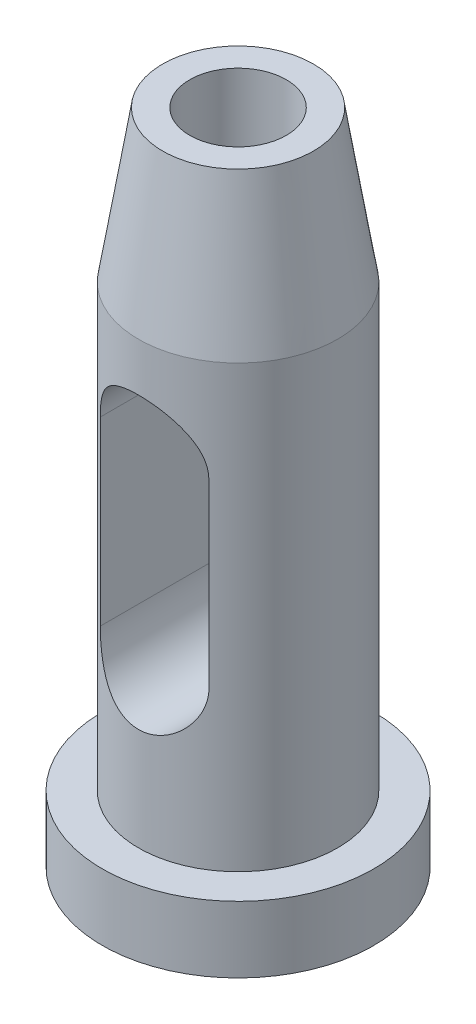
ISO-10303-21;
HEADER;
FILE_DESCRIPTION(('STEP AP214'),'2;1');
FILE_NAME('part.step','',(''),(''),'','','');
FILE_SCHEMA(('AUTOMOTIVE_DESIGN { 1 0 10303 214 1 1 1 1 }'));
ENDSEC;
DATA;
#1=APPLICATION_CONTEXT('core data for automotive mechanical design processes');
#2=APPLICATION_PROTOCOL_DEFINITION('international standard','automotive_design',2000,#1);
#3=PRODUCT_CONTEXT('',#1,'mechanical');
#4=PRODUCT('Part','Part','',(#3));
#5=PRODUCT_RELATED_PRODUCT_CATEGORY('part','',(#4));
#6=PRODUCT_DEFINITION_FORMATION('','',#4);
#7=PRODUCT_DEFINITION_CONTEXT('part definition',#1,'design');
#8=PRODUCT_DEFINITION('design','',#6,#7);
#9=PRODUCT_DEFINITION_SHAPE('','',#8);
#10=(LENGTH_UNIT() NAMED_UNIT(*) SI_UNIT(.MILLI.,.METRE.));
#11=(NAMED_UNIT(*) PLANE_ANGLE_UNIT() SI_UNIT($,.RADIAN.));
#12=(NAMED_UNIT(*) SI_UNIT($,.STERADIAN.) SOLID_ANGLE_UNIT());
#13=UNCERTAINTY_MEASURE_WITH_UNIT(LENGTH_MEASURE(1.E-05),#10,'distance_accuracy_value','');
#14=(GEOMETRIC_REPRESENTATION_CONTEXT(3) GLOBAL_UNCERTAINTY_ASSIGNED_CONTEXT((#13)) GLOBAL_UNIT_ASSIGNED_CONTEXT((#10,
#11,#12)) REPRESENTATION_CONTEXT('',''));
#15=CARTESIAN_POINT('',(0.,0.,0.));
#16=DIRECTION('',(0.,0.,1.));
#17=DIRECTION('',(1.,0.,0.));
#18=AXIS2_PLACEMENT_3D('',#15,#16,#17);
#19=CARTESIAN_POINT('',(0.,109.,0.));
#20=DIRECTION('',(0.,1.,0.));
#21=DIRECTION('',(0.,0.,1.));
#22=AXIS2_PLACEMENT_3D('',#19,#20,#21);
#23=PLANE('',#22);
#24=CARTESIAN_POINT('',(0.,109.,0.));
#25=DIRECTION('',(0.,1.,0.));
#26=DIRECTION('',(0.,0.,1.));
#27=AXIS2_PLACEMENT_3D('',#24,#25,#26);
#28=CIRCLE('',#27,8.);
#29=CARTESIAN_POINT('',(0.,109.,8.));
#30=VERTEX_POINT('',#29);
#31=EDGE_CURVE('E170',#30,#30,#28,.T.);
#32=ORIENTED_EDGE('',*,*,#31,.F.);
#33=EDGE_LOOP('',(#32));
#34=FACE_BOUND('',#33,.T.);
#35=CARTESIAN_POINT('',(0.,109.,0.));
#36=DIRECTION('',(0.,-1.,0.));
#37=DIRECTION('',(0.,0.,-1.));
#38=AXIS2_PLACEMENT_3D('',#35,#36,#37);
#39=CIRCLE('',#38,12.5);
#40=CARTESIAN_POINT('',(0.,109.,-12.5));
#41=VERTEX_POINT('',#40);
#42=EDGE_CURVE('E85',#41,#41,#39,.T.);
#43=ORIENTED_EDGE('',*,*,#42,.F.);
#44=EDGE_LOOP('',(#43));
#45=FACE_BOUND('',#44,.T.);
#46=ADVANCED_FACE('F37',(#34,#45),#23,.T.);
#47=CARTESIAN_POINT('',(0.,84.,0.));
#48=DIRECTION('',(0.,-1.,0.));
#49=DIRECTION('',(0.,0.,-1.));
#50=AXIS2_PLACEMENT_3D('',#47,#48,#49);
#51=CONICAL_SURFACE('',#50,16.5,0.158655262186401);
#52=ORIENTED_EDGE('',*,*,#42,.T.);
#53=EDGE_LOOP('',(#52));
#54=FACE_BOUND('',#53,.T.);
#55=CARTESIAN_POINT('',(0.,84.,0.));
#56=DIRECTION('',(0.,-1.,0.));
#57=DIRECTION('',(0.,0.,-1.));
#58=AXIS2_PLACEMENT_3D('',#55,#56,#57);
#59=CIRCLE('',#58,16.5);
#60=CARTESIAN_POINT('',(0.,84.,-16.5));
#61=VERTEX_POINT('',#60);
#62=EDGE_CURVE('E173',#61,#61,#59,.T.);
#63=ORIENTED_EDGE('',*,*,#62,.F.);
#64=EDGE_LOOP('',(#63));
#65=FACE_BOUND('',#64,.T.);
#66=ADVANCED_FACE('F158',(#54,#65),#51,.T.);
#67=CARTESIAN_POINT('',(0.,0.,0.));
#68=DIRECTION('',(0.,-1.,0.));
#69=DIRECTION('',(0.,0.,-1.));
#70=AXIS2_PLACEMENT_3D('',#67,#68,#69);
#71=CYLINDRICAL_SURFACE('',#70,16.5);
#72=CARTESIAN_POINT('',(-9.,67.,-13.8293166859393));
#73=CARTESIAN_POINT('',(-9.00000108405973,67.116120662201,-13.8293134815957));
#74=CARTESIAN_POINT('',(-8.99775214358709,67.232224323479,-13.8307798704048));
#75=CARTESIAN_POINT('',(-8.98877121495076,67.464178916627,-13.8366193112444));
#76=CARTESIAN_POINT('',(-8.98203946381125,67.5800298615344,-13.8409922095959));
#77=CARTESIAN_POINT('',(-8.95516299690755,67.9266636354463,-13.8584105490117));
#78=CARTESIAN_POINT('',(-8.92833699369042,68.1567595928819,-13.8757557630276));
#79=CARTESIAN_POINT('',(-8.85750818535109,68.6115816481385,-13.9210734017257));
#80=CARTESIAN_POINT('',(-8.8136216358978,68.8363333906915,-13.948973865982));
#81=CARTESIAN_POINT('',(-8.70925748833241,69.2805473704204,-14.0143719159858));
#82=CARTESIAN_POINT('',(-8.64877742316692,69.5000088157752,-14.051870928749));
#83=CARTESIAN_POINT('',(-8.51214530056127,69.9316328998316,-14.1350539016856));
#84=CARTESIAN_POINT('',(-8.43604118253432,70.1438156010994,-14.1807127706843));
#85=CARTESIAN_POINT('',(-8.26878667099399,70.5605655345755,-14.2788853710004));
#86=CARTESIAN_POINT('',(-8.17763046722479,70.7651297884701,-14.3314017477403));
#87=CARTESIAN_POINT('',(-7.88243166380445,71.3665575401875,-14.4971809528376));
#88=CARTESIAN_POINT('',(-7.65678284557668,71.7507690918926,-14.6185947922114));
#89=CARTESIAN_POINT('',(-7.12849041565851,72.5155648115348,-14.8838866236825));
#90=CARTESIAN_POINT('',(-6.82045172463468,72.892063006584,-15.0287993297978));
#91=CARTESIAN_POINT('',(-6.31599281999726,73.4161621629948,-15.2444045744132));
#92=CARTESIAN_POINT('',(-6.1406750094819,73.5841608221125,-15.3160142934886));
#93=CARTESIAN_POINT('',(-5.77646350594257,73.9059025430466,-15.4570552574956));
#94=CARTESIAN_POINT('',(-5.58756768228476,74.0596433588453,-15.5264861580652));
#95=CARTESIAN_POINT('',(-5.18051796077379,74.3642520198053,-15.6672413772284));
#96=CARTESIAN_POINT('',(-4.96124072193463,74.5137771655333,-15.7382291902257));
#97=CARTESIAN_POINT('',(-4.50895648334781,74.7935859293236,-15.8737205268866));
#98=CARTESIAN_POINT('',(-4.27595550165029,74.9238778948009,-15.9382268596804));
#99=CARTESIAN_POINT('',(-3.79761413251479,75.1639272193439,-16.058921036249));
#100=CARTESIAN_POINT('',(-3.55227747159335,75.273690733171,-16.1151113722364));
#101=CARTESIAN_POINT('',(-3.05094857264158,75.4713803570257,-16.2174945514723));
#102=CARTESIAN_POINT('',(-2.79495773064357,75.5593093176129,-16.2636886996486));
#103=CARTESIAN_POINT('',(-2.29578601596138,75.7058238162248,-16.3412924021232));
#104=CARTESIAN_POINT('',(-2.05327784299602,75.7662252182775,-16.3736041366231));
#105=CARTESIAN_POINT('',(-1.56293437886736,75.8667838603812,-16.4276612226379));
#106=CARTESIAN_POINT('',(-1.3150993550172,75.9069421138164,-16.4494071030839));
#107=CARTESIAN_POINT('',(-0.816366884020457,75.9664138024101,-16.4816853742425));
#108=CARTESIAN_POINT('',(-0.565471397355104,75.9857399390995,-16.4922245977025));
#109=CARTESIAN_POINT('',(-0.0627317539663041,76.0032945208937,-16.5017954787215));
#110=CARTESIAN_POINT('',(0.189112327848728,76.0015245983806,-16.50082802665));
#111=CARTESIAN_POINT('',(0.665502054373422,75.9781946230475,-16.4881140513944));
#112=CARTESIAN_POINT('',(0.890182334898732,75.9586960581395,-16.4774903933769));
#113=CARTESIAN_POINT('',(1.33685629531056,75.9030031594478,-16.4472768638071));
#114=CARTESIAN_POINT('',(1.55884996043612,75.8668087339756,-16.4276869430148));
#115=CARTESIAN_POINT('',(1.99861633516903,75.7781461699453,-16.380001691922));
#116=CARTESIAN_POINT('',(2.21638915830833,75.725678469752,-16.3519065907322));
#117=CARTESIAN_POINT('',(2.64635039092244,75.6050388863487,-16.287850823767));
#118=CARTESIAN_POINT('',(2.85853858450924,75.5368663970209,-16.2518898544155));
#119=CARTESIAN_POINT('',(3.27839087347572,75.3846613852831,-16.1724544241406));
#120=CARTESIAN_POINT('',(3.48598071121281,75.3004645048934,-16.1289025338257));
#121=CARTESIAN_POINT('',(3.89317238156783,75.117455572333,-16.0354892632859));
#122=CARTESIAN_POINT('',(4.09277155569198,75.0186387066015,-15.9856258057915));
#123=CARTESIAN_POINT('',(4.67808541889879,74.7014475173378,-15.8280900344313));
#124=CARTESIAN_POINT('',(5.05057142696184,74.4622392113397,-15.7124221771135));
#125=CARTESIAN_POINT('',(5.7915533699411,73.9061480806513,-15.4556692787488));
#126=CARTESIAN_POINT('',(6.1553916221143,73.5837035465141,-15.3131891684231));
#127=CARTESIAN_POINT('',(6.65848604251197,73.0599803074897,-15.0979492139108));
#128=CARTESIAN_POINT('',(6.8192035990735,72.8785418745553,-15.0258813463276));
#129=CARTESIAN_POINT('',(7.12576361305456,72.5029294469363,-14.8829449335362));
#130=CARTESIAN_POINT('',(7.27160350739421,72.3087532672656,-14.8120765967277));
#131=CARTESIAN_POINT('',(7.55952537759443,71.8911517242344,-14.667370449346));
#132=CARTESIAN_POINT('',(7.70018681476335,71.6666498244375,-14.593807402387));
#133=CARTESIAN_POINT('',(7.96181155290304,71.2047540757989,-14.4527381260324));
#134=CARTESIAN_POINT('',(8.08278383536833,70.9673661713701,-14.3852291413342));
#135=CARTESIAN_POINT('',(8.3036590486665,70.4814250028369,-14.2588712919875));
#136=CARTESIAN_POINT('',(8.40360853825212,70.23289792262,-14.2000033794566));
#137=CARTESIAN_POINT('',(8.58148374258626,69.7258469339792,-14.0932226684338));
#138=CARTESIAN_POINT('',(8.65941860622514,69.4673272292432,-14.0453053206661));
#139=CARTESIAN_POINT('',(8.7708010688933,69.0265511097627,-13.9759024717337));
#140=CARTESIAN_POINT('',(8.81050140549167,68.8464065715516,-13.9508676002974));
#141=CARTESIAN_POINT('',(8.87885237923901,68.4832724949966,-13.9074662102012));
#142=CARTESIAN_POINT('',(8.90750616740534,68.3002837834673,-13.8890977900302));
#143=CARTESIAN_POINT('',(8.95358220283994,67.9316486753548,-13.8594431186528));
#144=CARTESIAN_POINT('',(8.97096345546967,67.7459950604589,-13.8481827209869));
#145=CARTESIAN_POINT('',(8.99418564095055,67.3735664881097,-13.8331000847177));
#146=CARTESIAN_POINT('',(9.00002022862285,67.186790970654,-13.8292819358322));
#147=CARTESIAN_POINT('',(9.,67.,-13.8293166859393));
#148=B_SPLINE_CURVE_WITH_KNOTS('',3,(#72,#73,#74,#75,#76,#77,#78,#79,#80,#81,#82,#83,#84,#85,
#86,#87,#88,#89,#90,#91,#92,#93,#94,#95,#96,#97,#98,#99,#100,#101,#102,#103,#104,#105,#106,#107,
#108,#109,#110,#111,#112,#113,#114,#115,#116,#117,#118,#119,#120,#121,#122,#123,#124,#125,#126,
#127,#128,#129,#130,#131,#132,#133,#134,#135,#136,#137,#138,#139,#140,#141,#142,#143,#144,#145,
#146,#147),.UNSPECIFIED.,.F.,.F.,(4,2,2,2,2,2,2,2,2,2,2,2,2,2,2,2,2,2,2,2,2,2,2,2,2,2,2,2,2,2,2,
2,2,2,2,2,2,4),(0.,0.348297459707154,0.696576504992716,1.3924406946634,2.08364390864056,
2.77494994351385,3.46416571704895,4.15364815938687,5.53384137472791,7.05000030935542,
7.8088370664496,8.56779315968765,9.39093850464084,10.2137255382555,11.0362654901795,
11.8586980007831,12.6136393478522,13.3685428983421,14.1229859164749,14.8773705572975,
15.5538916107622,16.2304163795213,16.9069229258351,17.5834555859257,18.2673428369038,
18.951455757674,20.3188620596813,21.8320268865112,22.5900243598057,23.348152198926,
24.1719696394774,24.9954102240249,25.8170074892098,26.6382628090292,27.1963145005412,
27.7542068903533,28.3141169470545,28.8743346028807),.UNSPECIFIED.);
#149=CARTESIAN_POINT('',(-9.,67.,-13.8293166859394));
#150=VERTEX_POINT('',#149);
#151=CARTESIAN_POINT('',(9.,67.,-13.8293166859393));
#152=VERTEX_POINT('',#151);
#153=EDGE_CURVE('E11',#150,#152,#148,.T.);
#154=ORIENTED_EDGE('',*,*,#153,.F.);
#155=DIRECTION('',(0.,-1.,0.));
#156=VECTOR('',#155,1.);
#157=CARTESIAN_POINT('',(-8.99999999999997,0.,-13.8293166859394));
#158=LINE('',#157,#156);
#159=CARTESIAN_POINT('',(-8.99999999999997,37.,-13.8293166859394));
#160=VERTEX_POINT('',#159);
#161=EDGE_CURVE('E125',#160,#150,#158,.F.);
#162=ORIENTED_EDGE('',*,*,#161,.F.);
#163=CARTESIAN_POINT('',(9.,37.,-13.8293166859393));
#164=CARTESIAN_POINT('',(9.00000108405972,36.883879337799,-13.8293134815957));
#165=CARTESIAN_POINT('',(8.99775214358709,36.767775676521,-13.8307798704048));
#166=CARTESIAN_POINT('',(8.98877121495076,36.535821083373,-13.8366193112444));
#167=CARTESIAN_POINT('',(8.98203946381125,36.4199701384656,-13.8409922095959));
#168=CARTESIAN_POINT('',(8.95516299690755,36.0733363645537,-13.8584105490117));
#169=CARTESIAN_POINT('',(8.92833699369042,35.8432404071181,-13.8757557630276));
#170=CARTESIAN_POINT('',(8.85750818535109,35.3884183518615,-13.9210734017258));
#171=CARTESIAN_POINT('',(8.8136216358978,35.1636666093085,-13.948973865982));
#172=CARTESIAN_POINT('',(8.70925748833241,34.7194526295796,-14.0143719159858));
#173=CARTESIAN_POINT('',(8.64877742316692,34.4999911842248,-14.051870928749));
#174=CARTESIAN_POINT('',(8.51214530056127,34.0683671001684,-14.1350539016856));
#175=CARTESIAN_POINT('',(8.43604118253432,33.8561843989006,-14.1807127706843));
#176=CARTESIAN_POINT('',(8.26878667099399,33.4394344654245,-14.2788853710004));
#177=CARTESIAN_POINT('',(8.17763046722479,33.2348702115299,-14.3314017477403));
#178=CARTESIAN_POINT('',(7.88243166380446,32.6334424598125,-14.4971809528376));
#179=CARTESIAN_POINT('',(7.65678284557669,32.2492309081074,-14.6185947922114));
#180=CARTESIAN_POINT('',(7.12849041565852,31.4844351884652,-14.8838866236825));
#181=CARTESIAN_POINT('',(6.82045172463468,31.107936993416,-15.0287993297978));
#182=CARTESIAN_POINT('',(6.31599281999726,30.5838378370052,-15.2444045744132));
#183=CARTESIAN_POINT('',(6.14067500948191,30.4158391778875,-15.3160142934886));
#184=CARTESIAN_POINT('',(5.77646350594258,30.0940974569534,-15.4570552574956));
#185=CARTESIAN_POINT('',(5.58756768228476,29.9403566411547,-15.5264861580652));
#186=CARTESIAN_POINT('',(5.18051796077379,29.6357479801948,-15.6672413772284));
#187=CARTESIAN_POINT('',(4.96124072193463,29.4862228344667,-15.7382291902257));
#188=CARTESIAN_POINT('',(4.50895648334781,29.2064140706764,-15.8737205268867));
#189=CARTESIAN_POINT('',(4.27595550165029,29.0761221051991,-15.9382268596804));
#190=CARTESIAN_POINT('',(3.79761413251479,28.8360727806561,-16.058921036249));
#191=CARTESIAN_POINT('',(3.55227747159335,28.726309266829,-16.1151113722364));
#192=CARTESIAN_POINT('',(3.05094857264158,28.5286196429743,-16.2174945514723));
#193=CARTESIAN_POINT('',(2.79495773064357,28.4406906823871,-16.2636886996486));
#194=CARTESIAN_POINT('',(2.29578601596138,28.2941761837753,-16.3412924021232));
#195=CARTESIAN_POINT('',(2.05327784299603,28.2337747817225,-16.3736041366231));
#196=CARTESIAN_POINT('',(1.56293437886736,28.1332161396188,-16.4276612226379));
#197=CARTESIAN_POINT('',(1.3150993550172,28.0930578861836,-16.4494071030839));
#198=CARTESIAN_POINT('',(0.816366884020465,28.0335861975899,-16.4816853742425));
#199=CARTESIAN_POINT('',(0.565471397355112,28.0142600609005,-16.4922245977025));
#200=CARTESIAN_POINT('',(0.062731753966313,27.9967054791063,-16.5017954787215));
#201=CARTESIAN_POINT('',(-0.189112327848718,27.9984754016194,-16.50082802665));
#202=CARTESIAN_POINT('',(-0.665502054373412,28.0218053769525,-16.4881140513944));
#203=CARTESIAN_POINT('',(-0.890182334898721,28.0413039418605,-16.4774903933769));
#204=CARTESIAN_POINT('',(-1.33685629531054,28.0969968405522,-16.4472768638071));
#205=CARTESIAN_POINT('',(-1.5588499604361,28.1331912660244,-16.4276869430148));
#206=CARTESIAN_POINT('',(-1.99861633516902,28.2218538300547,-16.380001691922));
#207=CARTESIAN_POINT('',(-2.21638915830831,28.274321530248,-16.3519065907322));
#208=CARTESIAN_POINT('',(-2.64635039092243,28.3949611136514,-16.2878508237671));
#209=CARTESIAN_POINT('',(-2.85853858450923,28.4631336029791,-16.2518898544155));
#210=CARTESIAN_POINT('',(-3.27839087347571,28.6153386147169,-16.1724544241406));
#211=CARTESIAN_POINT('',(-3.4859807112128,28.6995354951066,-16.1289025338257));
#212=CARTESIAN_POINT('',(-3.89317238156782,28.882544427667,-16.0354892632859));
#213=CARTESIAN_POINT('',(-4.09277155569197,28.9813612933985,-15.9856258057915));
#214=CARTESIAN_POINT('',(-4.67808541889878,29.2985524826622,-15.8280900344313));
#215=CARTESIAN_POINT('',(-5.05057142696183,29.5377607886603,-15.7124221771135));
#216=CARTESIAN_POINT('',(-5.7915533699411,30.0938519193487,-15.4556692787488));
#217=CARTESIAN_POINT('',(-6.15539162211429,30.416296453486,-15.3131891684231));
#218=CARTESIAN_POINT('',(-6.65848604251196,30.9400196925103,-15.0979492139108));
#219=CARTESIAN_POINT('',(-6.81920359907349,31.1214581254447,-15.0258813463276));
#220=CARTESIAN_POINT('',(-7.12576361305456,31.4970705530637,-14.8829449335362));
#221=CARTESIAN_POINT('',(-7.2716035073942,31.6912467327344,-14.8120765967277));
#222=CARTESIAN_POINT('',(-7.55952537759442,32.1088482757656,-14.667370449346));
#223=CARTESIAN_POINT('',(-7.70018681476334,32.3333501755625,-14.593807402387));
#224=CARTESIAN_POINT('',(-7.96181155290302,32.7952459242011,-14.4527381260324));
#225=CARTESIAN_POINT('',(-8.08278383536832,33.0326338286299,-14.3852291413342));
#226=CARTESIAN_POINT('',(-8.30365904866648,33.5185749971631,-14.2588712919875));
#227=CARTESIAN_POINT('',(-8.40360853825211,33.76710207738,-14.2000033794566));
#228=CARTESIAN_POINT('',(-8.58148374258625,34.2741530660208,-14.0932226684338));
#229=CARTESIAN_POINT('',(-8.65941860622513,34.5326727707568,-14.0453053206661));
#230=CARTESIAN_POINT('',(-8.77080106889328,34.9734488902373,-13.9759024717337));
#231=CARTESIAN_POINT('',(-8.81050140549165,35.1535934284483,-13.9508676002974));
#232=CARTESIAN_POINT('',(-8.878852379239,35.5167275050034,-13.9074662102012));
#233=CARTESIAN_POINT('',(-8.90750616740533,35.6997162165327,-13.8890977900302));
#234=CARTESIAN_POINT('',(-8.95358220283993,36.0683513246453,-13.8594431186529));
#235=CARTESIAN_POINT('',(-8.97096345546966,36.2540049395412,-13.8481827209869));
#236=CARTESIAN_POINT('',(-8.99418564095054,36.6264335118903,-13.8331000847177));
#237=CARTESIAN_POINT('',(-9.00002022862283,36.8132090293461,-13.8292819358322));
#238=CARTESIAN_POINT('',(-8.99999999999999,37.,-13.8293166859393));
#239=B_SPLINE_CURVE_WITH_KNOTS('',3,(#163,#164,#165,#166,#167,#168,#169,#170,#171,#172,#173,
#174,#175,#176,#177,#178,#179,#180,#181,#182,#183,#184,#185,#186,#187,#188,#189,#190,#191,#192,
#193,#194,#195,#196,#197,#198,#199,#200,#201,#202,#203,#204,#205,#206,#207,#208,#209,#210,#211,
#212,#213,#214,#215,#216,#217,#218,#219,#220,#221,#222,#223,#224,#225,#226,#227,#228,#229,#230,
#231,#232,#233,#234,#235,#236,#237,#238),.UNSPECIFIED.,.F.,.F.,(4,2,2,2,2,2,2,2,2,2,2,2,2,2,2,2,
2,2,2,2,2,2,2,2,2,2,2,2,2,2,2,2,2,2,2,2,2,4),(0.,0.348297459707134,0.696576504992709,
1.39244069466339,2.08364390864055,2.77494994351384,3.46416571704894,4.15364815938685,
5.5338413747279,7.05000030935541,7.80883706644959,8.56779315968764,9.39093850464084,
10.2137255382555,11.0362654901795,11.8586980007831,12.6136393478522,13.3685428983421,
14.1229859164748,14.8773705572975,15.5538916107622,16.2304163795213,16.9069229258351,
17.5834555859257,18.2673428369038,18.951455757674,20.3188620596813,21.8320268865112,
22.5900243598057,23.348152198926,24.1719696394774,24.9954102240248,25.8170074892098,
26.6382628090291,27.1963145005412,27.7542068903533,28.3141169470545,28.8743346028806),.UNSPECIFIED.);
#240=CARTESIAN_POINT('',(9.,37.,-13.8293166859393));
#241=VERTEX_POINT('',#240);
#242=EDGE_CURVE('E92',#241,#160,#239,.T.);
#243=ORIENTED_EDGE('',*,*,#242,.F.);
#244=DIRECTION('',(0.,-1.,0.));
#245=VECTOR('',#244,1.);
#246=CARTESIAN_POINT('',(8.99999999999999,0.,-13.8293166859393));
#247=LINE('',#246,#245);
#248=EDGE_CURVE('E50',#152,#241,#247,.T.);
#249=ORIENTED_EDGE('',*,*,#248,.F.);
#250=EDGE_LOOP('',(#154,#162,#243,#249));
#251=FACE_BOUND('',#250,.T.);
#252=CARTESIAN_POINT('',(9.,67.,13.8293166859393));
#253=CARTESIAN_POINT('',(9.00000108405973,67.116120662201,13.8293134815957));
#254=CARTESIAN_POINT('',(8.99775214358709,67.232224323479,13.8307798704048));
#255=CARTESIAN_POINT('',(8.98877121495077,67.464178916627,13.8366193112444));
#256=CARTESIAN_POINT('',(8.98203946381126,67.5800298615344,13.8409922095959));
#257=CARTESIAN_POINT('',(8.95516299690755,67.9266636354463,13.8584105490117));
#258=CARTESIAN_POINT('',(8.92833699369042,68.1567595928819,13.8757557630276));
#259=CARTESIAN_POINT('',(8.85750818535109,68.6115816481385,13.9210734017257));
#260=CARTESIAN_POINT('',(8.81362163589781,68.8363333906915,13.948973865982));
#261=CARTESIAN_POINT('',(8.70925748833242,69.2805473704204,14.0143719159858));
#262=CARTESIAN_POINT('',(8.64877742316692,69.5000088157752,14.051870928749));
#263=CARTESIAN_POINT('',(8.51214530056128,69.9316328998316,14.1350539016856));
#264=CARTESIAN_POINT('',(8.43604118253433,70.1438156010994,14.1807127706843));
#265=CARTESIAN_POINT('',(8.268786670994,70.5605655345755,14.2788853710004));
#266=CARTESIAN_POINT('',(8.1776304672248,70.7651297884701,14.3314017477403));
#267=CARTESIAN_POINT('',(7.88243166380447,71.3665575401875,14.4971809528376));
#268=CARTESIAN_POINT('',(7.6567828455767,71.7507690918926,14.6185947922114));
#269=CARTESIAN_POINT('',(7.12849041565852,72.5155648115348,14.8838866236825));
#270=CARTESIAN_POINT('',(6.82045172463468,72.892063006584,15.0287993297978));
#271=CARTESIAN_POINT('',(6.31599281999726,73.4161621629948,15.2444045744132));
#272=CARTESIAN_POINT('',(6.1406750094819,73.5841608221125,15.3160142934886));
#273=CARTESIAN_POINT('',(5.77646350594257,73.9059025430466,15.4570552574956));
#274=CARTESIAN_POINT('',(5.58756768228476,74.0596433588453,15.5264861580652));
#275=CARTESIAN_POINT('',(5.18051796077379,74.3642520198053,15.6672413772284));
#276=CARTESIAN_POINT('',(4.96124072193463,74.5137771655333,15.7382291902257));
#277=CARTESIAN_POINT('',(4.50895648334781,74.7935859293236,15.8737205268866));
#278=CARTESIAN_POINT('',(4.27595550165029,74.9238778948009,15.9382268596804));
#279=CARTESIAN_POINT('',(3.79761413251479,75.1639272193439,16.058921036249));
#280=CARTESIAN_POINT('',(3.55227747159335,75.273690733171,16.1151113722364));
#281=CARTESIAN_POINT('',(3.05094857264158,75.4713803570257,16.2174945514723));
#282=CARTESIAN_POINT('',(2.79495773064357,75.5593093176129,16.2636886996486));
#283=CARTESIAN_POINT('',(2.29578601596139,75.7058238162248,16.3412924021232));
#284=CARTESIAN_POINT('',(2.05327784299603,75.7662252182775,16.3736041366231));
#285=CARTESIAN_POINT('',(1.56293437886736,75.8667838603812,16.4276612226379));
#286=CARTESIAN_POINT('',(1.3150993550172,75.9069421138164,16.4494071030839));
#287=CARTESIAN_POINT('',(0.816366884020461,75.9664138024101,16.4816853742425));
#288=CARTESIAN_POINT('',(0.565471397355109,75.9857399390995,16.4922245977025));
#289=CARTESIAN_POINT('',(0.0627317539663081,76.0032945208937,16.5017954787215));
#290=CARTESIAN_POINT('',(-0.189112327848723,76.0015245983806,16.50082802665));
#291=CARTESIAN_POINT('',(-0.665502054373418,75.9781946230475,16.4881140513944));
#292=CARTESIAN_POINT('',(-0.890182334898728,75.9586960581395,16.4774903933769));
#293=CARTESIAN_POINT('',(-1.33685629531055,75.9030031594478,16.4472768638071));
#294=CARTESIAN_POINT('',(-1.55884996043611,75.8668087339756,16.4276869430148));
#295=CARTESIAN_POINT('',(-1.99861633516903,75.7781461699453,16.380001691922));
#296=CARTESIAN_POINT('',(-2.21638915830832,75.725678469752,16.3519065907322));
#297=CARTESIAN_POINT('',(-2.64635039092243,75.6050388863487,16.287850823767));
#298=CARTESIAN_POINT('',(-2.85853858450924,75.5368663970209,16.2518898544155));
#299=CARTESIAN_POINT('',(-3.27839087347572,75.3846613852831,16.1724544241406));
#300=CARTESIAN_POINT('',(-3.48598071121281,75.3004645048934,16.1289025338257));
#301=CARTESIAN_POINT('',(-3.89317238156783,75.117455572333,16.0354892632859));
#302=CARTESIAN_POINT('',(-4.09277155569198,75.0186387066015,15.9856258057915));
#303=CARTESIAN_POINT('',(-4.67808541889879,74.7014475173378,15.8280900344313));
#304=CARTESIAN_POINT('',(-5.05057142696184,74.4622392113397,15.7124221771135));
#305=CARTESIAN_POINT('',(-5.7915533699411,73.9061480806513,15.4556692787488));
#306=CARTESIAN_POINT('',(-6.1553916221143,73.5837035465141,15.3131891684231));
#307=CARTESIAN_POINT('',(-6.65848604251197,73.0599803074897,15.0979492139108));
#308=CARTESIAN_POINT('',(-6.81920359907351,72.8785418745553,15.0258813463276));
#309=CARTESIAN_POINT('',(-7.12576361305457,72.5029294469363,14.8829449335362));
#310=CARTESIAN_POINT('',(-7.27160350739421,72.3087532672656,14.8120765967277));
#311=CARTESIAN_POINT('',(-7.55952537759443,71.8911517242344,14.667370449346));
#312=CARTESIAN_POINT('',(-7.70018681476335,71.6666498244375,14.593807402387));
#313=CARTESIAN_POINT('',(-7.96181155290304,71.2047540757989,14.4527381260324));
#314=CARTESIAN_POINT('',(-8.08278383536833,70.9673661713701,14.3852291413342));
#315=CARTESIAN_POINT('',(-8.3036590486665,70.4814250028369,14.2588712919875));
#316=CARTESIAN_POINT('',(-8.40360853825213,70.23289792262,14.2000033794566));
#317=CARTESIAN_POINT('',(-8.58148374258626,69.7258469339792,14.0932226684338));
#318=CARTESIAN_POINT('',(-8.65941860622515,69.4673272292432,14.0453053206661));
#319=CARTESIAN_POINT('',(-8.77080106889329,69.0265511097627,13.9759024717337));
#320=CARTESIAN_POINT('',(-8.81050140549166,68.8464065715516,13.9508676002974));
#321=CARTESIAN_POINT('',(-8.87885237923901,68.4832724949966,13.9074662102012));
#322=CARTESIAN_POINT('',(-8.90750616740534,68.3002837834673,13.8890977900302));
#323=CARTESIAN_POINT('',(-8.95358220283994,67.9316486753548,13.8594431186528));
#324=CARTESIAN_POINT('',(-8.97096345546966,67.7459950604589,13.8481827209869));
#325=CARTESIAN_POINT('',(-8.99418564095055,67.3735664881097,13.8331000847177));
#326=CARTESIAN_POINT('',(-9.00002022862284,67.186790970654,13.8292819358322));
#327=CARTESIAN_POINT('',(-9.,67.,13.8293166859393));
#328=B_SPLINE_CURVE_WITH_KNOTS('',3,(#252,#253,#254,#255,#256,#257,#258,#259,#260,#261,#262,
#263,#264,#265,#266,#267,#268,#269,#270,#271,#272,#273,#274,#275,#276,#277,#278,#279,#280,#281,
#282,#283,#284,#285,#286,#287,#288,#289,#290,#291,#292,#293,#294,#295,#296,#297,#298,#299,#300,
#301,#302,#303,#304,#305,#306,#307,#308,#309,#310,#311,#312,#313,#314,#315,#316,#317,#318,#319,
#320,#321,#322,#323,#324,#325,#326,#327),.UNSPECIFIED.,.F.,.F.,(4,2,2,2,2,2,2,2,2,2,2,2,2,2,2,2,
2,2,2,2,2,2,2,2,2,2,2,2,2,2,2,2,2,2,2,2,2,4),(0.,0.348297459707155,0.696576504992716,
1.3924406946634,2.08364390864053,2.77494994351385,3.46416571704893,4.15364815938683,
5.5338413747279,7.05000030935542,7.80883706644962,8.56779315968765,9.39093850464085,
10.2137255382555,11.0362654901795,11.8586980007831,12.6136393478522,13.3685428983421,
14.1229859164749,14.8773705572975,15.5538916107622,16.2304163795213,16.9069229258351,
17.5834555859257,18.2673428369038,18.951455757674,20.3188620596813,21.8320268865112,
22.5900243598057,23.348152198926,24.1719696394774,24.9954102240249,25.8170074892098,
26.6382628090292,27.1963145005413,27.7542068903534,28.3141169470546,28.8743346028807),.UNSPECIFIED.);
#329=CARTESIAN_POINT('',(9.,67.,13.8293166859393));
#330=VERTEX_POINT('',#329);
#331=CARTESIAN_POINT('',(-8.99999999999997,67.,13.8293166859394));
#332=VERTEX_POINT('',#331);
#333=EDGE_CURVE('E101',#330,#332,#328,.T.);
#334=ORIENTED_EDGE('',*,*,#333,.F.);
#335=DIRECTION('',(0.,-1.,0.));
#336=VECTOR('',#335,1.);
#337=CARTESIAN_POINT('',(8.99999999999999,0.,13.8293166859393));
#338=LINE('',#337,#336);
#339=CARTESIAN_POINT('',(9.,37.,13.8293166859393));
#340=VERTEX_POINT('',#339);
#341=EDGE_CURVE('E99',#340,#330,#338,.F.);
#342=ORIENTED_EDGE('',*,*,#341,.F.);
#343=CARTESIAN_POINT('',(-8.99999999999999,37.,13.8293166859393));
#344=CARTESIAN_POINT('',(-9.00000108405972,36.883879337799,13.8293134815957));
#345=CARTESIAN_POINT('',(-8.99775214358708,36.767775676521,13.8307798704048));
#346=CARTESIAN_POINT('',(-8.98877121495075,36.535821083373,13.8366193112444));
#347=CARTESIAN_POINT('',(-8.98203946381124,36.4199701384656,13.840992209596));
#348=CARTESIAN_POINT('',(-8.95516299690754,36.0733363645537,13.8584105490117));
#349=CARTESIAN_POINT('',(-8.92833699369041,35.8432404071181,13.8757557630276));
#350=CARTESIAN_POINT('',(-8.85750818535108,35.3884183518616,13.9210734017258));
#351=CARTESIAN_POINT('',(-8.8136216358978,35.1636666093085,13.948973865982));
#352=CARTESIAN_POINT('',(-8.70925748833241,34.7194526295796,14.0143719159858));
#353=CARTESIAN_POINT('',(-8.64877742316691,34.4999911842248,14.051870928749));
#354=CARTESIAN_POINT('',(-8.51214530056126,34.0683671001684,14.1350539016856));
#355=CARTESIAN_POINT('',(-8.43604118253431,33.8561843989006,14.1807127706843));
#356=CARTESIAN_POINT('',(-8.26878667099398,33.4394344654245,14.2788853710004));
#357=CARTESIAN_POINT('',(-8.17763046722478,33.2348702115299,14.3314017477403));
#358=CARTESIAN_POINT('',(-7.88243166380445,32.6334424598125,14.4971809528376));
#359=CARTESIAN_POINT('',(-7.65678284557668,32.2492309081074,14.6185947922114));
#360=CARTESIAN_POINT('',(-7.12849041565851,31.4844351884652,14.8838866236825));
#361=CARTESIAN_POINT('',(-6.82045172463468,31.107936993416,15.0287993297978));
#362=CARTESIAN_POINT('',(-6.31599281999726,30.5838378370052,15.2444045744132));
#363=CARTESIAN_POINT('',(-6.1406750094819,30.4158391778875,15.3160142934886));
#364=CARTESIAN_POINT('',(-5.77646350594257,30.0940974569534,15.4570552574956));
#365=CARTESIAN_POINT('',(-5.58756768228476,29.9403566411547,15.5264861580652));
#366=CARTESIAN_POINT('',(-5.18051796077379,29.6357479801948,15.6672413772284));
#367=CARTESIAN_POINT('',(-4.96124072193463,29.4862228344667,15.7382291902257));
#368=CARTESIAN_POINT('',(-4.50895648334781,29.2064140706765,15.8737205268867));
#369=CARTESIAN_POINT('',(-4.27595550165029,29.0761221051991,15.9382268596804));
#370=CARTESIAN_POINT('',(-3.79761413251478,28.8360727806561,16.058921036249));
#371=CARTESIAN_POINT('',(-3.55227747159335,28.726309266829,16.1151113722364));
#372=CARTESIAN_POINT('',(-3.05094857264158,28.5286196429743,16.2174945514723));
#373=CARTESIAN_POINT('',(-2.79495773064357,28.4406906823871,16.2636886996486));
#374=CARTESIAN_POINT('',(-2.29578601596138,28.2941761837753,16.3412924021232));
#375=CARTESIAN_POINT('',(-2.05327784299603,28.2337747817225,16.3736041366231));
#376=CARTESIAN_POINT('',(-1.56293437886736,28.1332161396188,16.4276612226379));
#377=CARTESIAN_POINT('',(-1.3150993550172,28.0930578861836,16.4494071030839));
#378=CARTESIAN_POINT('',(-0.816366884020463,28.0335861975899,16.4816853742425));
#379=CARTESIAN_POINT('',(-0.56547139735511,28.0142600609005,16.4922245977025));
#380=CARTESIAN_POINT('',(-0.0627317539663092,27.9967054791063,16.5017954787215));
#381=CARTESIAN_POINT('',(0.189112327848722,27.9984754016194,16.50082802665));
#382=CARTESIAN_POINT('',(0.665502054373418,28.0218053769525,16.4881140513944));
#383=CARTESIAN_POINT('',(0.890182334898728,28.0413039418605,16.4774903933769));
#384=CARTESIAN_POINT('',(1.33685629531055,28.0969968405522,16.4472768638071));
#385=CARTESIAN_POINT('',(1.55884996043611,28.1331912660244,16.4276869430148));
#386=CARTESIAN_POINT('',(1.99861633516903,28.2218538300547,16.380001691922));
#387=CARTESIAN_POINT('',(2.21638915830832,28.274321530248,16.3519065907322));
#388=CARTESIAN_POINT('',(2.64635039092243,28.3949611136514,16.287850823767));
#389=CARTESIAN_POINT('',(2.85853858450924,28.4631336029791,16.2518898544155));
#390=CARTESIAN_POINT('',(3.27839087347572,28.6153386147169,16.1724544241406));
#391=CARTESIAN_POINT('',(3.48598071121281,28.6995354951066,16.1289025338257));
#392=CARTESIAN_POINT('',(3.89317238156783,28.882544427667,16.0354892632859));
#393=CARTESIAN_POINT('',(4.09277155569198,28.9813612933985,15.9856258057915));
#394=CARTESIAN_POINT('',(4.67808541889879,29.2985524826622,15.8280900344313));
#395=CARTESIAN_POINT('',(5.05057142696184,29.5377607886603,15.7124221771135));
#396=CARTESIAN_POINT('',(5.7915533699411,30.0938519193487,15.4556692787488));
#397=CARTESIAN_POINT('',(6.1553916221143,30.416296453486,15.3131891684231));
#398=CARTESIAN_POINT('',(6.65848604251197,30.9400196925103,15.0979492139108));
#399=CARTESIAN_POINT('',(6.81920359907351,31.1214581254447,15.0258813463276));
#400=CARTESIAN_POINT('',(7.12576361305457,31.4970705530637,14.8829449335362));
#401=CARTESIAN_POINT('',(7.27160350739421,31.6912467327344,14.8120765967277));
#402=CARTESIAN_POINT('',(7.55952537759443,32.1088482757656,14.667370449346));
#403=CARTESIAN_POINT('',(7.70018681476335,32.3333501755625,14.593807402387));
#404=CARTESIAN_POINT('',(7.96181155290303,32.7952459242011,14.4527381260324));
#405=CARTESIAN_POINT('',(8.08278383536832,33.0326338286299,14.3852291413342));
#406=CARTESIAN_POINT('',(8.30365904866649,33.5185749971631,14.2588712919875));
#407=CARTESIAN_POINT('',(8.40360853825212,33.76710207738,14.2000033794566));
#408=CARTESIAN_POINT('',(8.58148374258626,34.2741530660208,14.0932226684338));
#409=CARTESIAN_POINT('',(8.65941860622514,34.5326727707568,14.0453053206661));
#410=CARTESIAN_POINT('',(8.77080106889329,34.9734488902373,13.9759024717337));
#411=CARTESIAN_POINT('',(8.81050140549166,35.1535934284484,13.9508676002974));
#412=CARTESIAN_POINT('',(8.87885237923901,35.5167275050034,13.9074662102012));
#413=CARTESIAN_POINT('',(8.90750616740533,35.6997162165327,13.8890977900302));
#414=CARTESIAN_POINT('',(8.95358220283994,36.0683513246452,13.8594431186528));
#415=CARTESIAN_POINT('',(8.97096345546966,36.2540049395411,13.8481827209869));
#416=CARTESIAN_POINT('',(8.99418564095055,36.6264335118903,13.8331000847177));
#417=CARTESIAN_POINT('',(9.00002022862284,36.8132090293461,13.8292819358322));
#418=CARTESIAN_POINT('',(9.,37.,13.8293166859393));
#419=B_SPLINE_CURVE_WITH_KNOTS('',3,(#343,#344,#345,#346,#347,#348,#349,#350,#351,#352,#353,
#354,#355,#356,#357,#358,#359,#360,#361,#362,#363,#364,#365,#366,#367,#368,#369,#370,#371,#372,
#373,#374,#375,#376,#377,#378,#379,#380,#381,#382,#383,#384,#385,#386,#387,#388,#389,#390,#391,
#392,#393,#394,#395,#396,#397,#398,#399,#400,#401,#402,#403,#404,#405,#406,#407,#408,#409,#410,
#411,#412,#413,#414,#415,#416,#417,#418),.UNSPECIFIED.,.F.,.F.,(4,2,2,2,2,2,2,2,2,2,2,2,2,2,2,2,
2,2,2,2,2,2,2,2,2,2,2,2,2,2,2,2,2,2,2,2,2,4),(0.,0.348297459707134,0.696576504992709,
1.39244069466338,2.08364390864054,2.77494994351384,3.46416571704894,4.15364815938686,
5.5338413747279,7.05000030935541,7.80883706644959,8.56779315968764,9.39093850464083,
10.2137255382555,11.0362654901795,11.8586980007831,12.6136393478521,13.3685428983421,
14.1229859164748,14.8773705572975,15.5538916107622,16.2304163795213,16.9069229258351,
17.5834555859257,18.2673428369038,18.951455757674,20.3188620596813,21.8320268865112,
22.5900243598057,23.348152198926,24.1719696394774,24.9954102240248,25.8170074892098,
26.6382628090291,27.1963145005412,27.7542068903533,28.3141169470545,28.8743346028806),.UNSPECIFIED.);
#420=CARTESIAN_POINT('',(-8.99999999999999,37.,13.8293166859393));
#421=VERTEX_POINT('',#420);
#422=EDGE_CURVE('E84',#421,#340,#419,.T.);
#423=ORIENTED_EDGE('',*,*,#422,.F.);
#424=DIRECTION('',(0.,-1.,0.));
#425=VECTOR('',#424,1.);
#426=CARTESIAN_POINT('',(-8.99999999999997,0.,13.8293166859394));
#427=LINE('',#426,#425);
#428=EDGE_CURVE('E79',#332,#421,#427,.T.);
#429=ORIENTED_EDGE('',*,*,#428,.F.);
#430=EDGE_LOOP('',(#334,#342,#423,#429));
#431=FACE_BOUND('',#430,.T.);
#432=ORIENTED_EDGE('',*,*,#62,.T.);
#433=EDGE_LOOP('',(#432));
#434=FACE_BOUND('',#433,.T.);
#435=CARTESIAN_POINT('',(0.,11.,0.));
#436=DIRECTION('',(0.,-1.,0.));
#437=DIRECTION('',(0.,0.,-1.));
#438=AXIS2_PLACEMENT_3D('',#435,#436,#437);
#439=CIRCLE('',#438,16.5);
#440=CARTESIAN_POINT('',(0.,11.,-16.5));
#441=VERTEX_POINT('',#440);
#442=EDGE_CURVE('E175',#441,#441,#439,.T.);
#443=ORIENTED_EDGE('',*,*,#442,.F.);
#444=EDGE_LOOP('',(#443));
#445=FACE_BOUND('',#444,.T.);
#446=ADVANCED_FACE('F97',(#251,#431,#434,#445),#71,.T.);
#447=CARTESIAN_POINT('',(22.5,11.,0.));
#448=DIRECTION('',(0.,1.,0.));
#449=DIRECTION('',(0.,0.,1.));
#450=AXIS2_PLACEMENT_3D('',#447,#448,#449);
#451=PLANE('',#450);
#452=ORIENTED_EDGE('',*,*,#442,.T.);
#453=EDGE_LOOP('',(#452));
#454=FACE_BOUND('',#453,.T.);
#455=CARTESIAN_POINT('',(0.,11.,0.));
#456=DIRECTION('',(0.,-1.,0.));
#457=DIRECTION('',(0.,0.,-1.));
#458=AXIS2_PLACEMENT_3D('',#455,#456,#457);
#459=CIRCLE('',#458,22.5);
#460=CARTESIAN_POINT('',(0.,11.,-22.5));
#461=VERTEX_POINT('',#460);
#462=EDGE_CURVE('E179',#461,#461,#459,.T.);
#463=ORIENTED_EDGE('',*,*,#462,.F.);
#464=EDGE_LOOP('',(#463));
#465=FACE_BOUND('',#464,.T.);
#466=ADVANCED_FACE('F151',(#454,#465),#451,.T.);
#467=CARTESIAN_POINT('',(0.,0.,0.));
#468=DIRECTION('',(0.,-1.,0.));
#469=DIRECTION('',(0.,0.,-1.));
#470=AXIS2_PLACEMENT_3D('',#467,#468,#469);
#471=CYLINDRICAL_SURFACE('',#470,22.5);
#472=ORIENTED_EDGE('',*,*,#462,.T.);
#473=EDGE_LOOP('',(#472));
#474=FACE_BOUND('',#473,.T.);
#475=CARTESIAN_POINT('',(0.,0.,0.));
#476=DIRECTION('',(0.,-1.,0.));
#477=DIRECTION('',(0.,0.,-1.));
#478=AXIS2_PLACEMENT_3D('',#475,#476,#477);
#479=CIRCLE('',#478,22.5);
#480=CARTESIAN_POINT('',(0.,0.,-22.5));
#481=VERTEX_POINT('',#480);
#482=EDGE_CURVE('E182',#481,#481,#479,.T.);
#483=ORIENTED_EDGE('',*,*,#482,.F.);
#484=EDGE_LOOP('',(#483));
#485=FACE_BOUND('',#484,.T.);
#486=ADVANCED_FACE('F148',(#474,#485),#471,.T.);
#487=CARTESIAN_POINT('',(0.,0.,0.));
#488=DIRECTION('',(0.,-1.,0.));
#489=DIRECTION('',(0.,0.,-1.));
#490=AXIS2_PLACEMENT_3D('',#487,#488,#489);
#491=PLANE('',#490);
#492=ORIENTED_EDGE('',*,*,#482,.T.);
#493=EDGE_LOOP('',(#492));
#494=FACE_BOUND('',#493,.T.);
#495=ADVANCED_FACE('F143',(#494),#491,.T.);
#496=CARTESIAN_POINT('',(0.,67.,-22.5));
#497=DIRECTION('',(0.,0.,1.));
#498=DIRECTION('',(1.,0.,0.));
#499=AXIS2_PLACEMENT_3D('',#496,#497,#498);
#500=CYLINDRICAL_SURFACE('',#499,9.);
#501=CARTESIAN_POINT('',(0.,76.,8.));
#502=CARTESIAN_POINT('',(-0.186012270472923,75.9999982147557,7.99999819217));
#503=CARTESIAN_POINT('',(-0.372061894134603,75.9942201265777,7.99349935534697));
#504=CARTESIAN_POINT('',(-0.74263329297767,75.9712315702552,7.96762387173417));
#505=CARTESIAN_POINT('',(-0.927154129023269,75.9540145362393,7.94823982892711));
#506=CARTESIAN_POINT('',(-1.29338749112095,75.9084935467341,7.89692331364466));
#507=CARTESIAN_POINT('',(-1.47509446056546,75.8801699964476,7.8649686630103));
#508=CARTESIAN_POINT('',(-1.83408642791194,75.8130298798314,7.78908262927891));
#509=CARTESIAN_POINT('',(-2.01136929889185,75.7742083687713,7.74514560218149));
#510=CARTESIAN_POINT('',(-2.35899028939158,75.6871764212577,7.64640918671325));
#511=CARTESIAN_POINT('',(-2.52937031750564,75.6390381097797,7.59169318788259));
#512=CARTESIAN_POINT('',(-2.86377023574463,75.5340232068339,7.47197286604092));
#513=CARTESIAN_POINT('',(-3.02778729219915,75.4771427768715,7.40696402326185));
#514=CARTESIAN_POINT('',(-3.34866274008046,75.3555897708379,7.26753375322852));
#515=CARTESIAN_POINT('',(-3.5055243409044,75.2909207364824,7.1931166034582));
#516=CARTESIAN_POINT('',(-3.81174485081793,75.1546735544447,7.03564200652735));
#517=CARTESIAN_POINT('',(-3.96110207849971,75.0830938687856,6.95258263570494));
#518=CARTESIAN_POINT('',(-4.30919674417141,74.9045974861545,6.74437289604258));
#519=CARTESIAN_POINT('',(-4.50427420262921,74.7948482401484,6.61550863150236));
#520=CARTESIAN_POINT('',(-4.87887171147667,74.5660297541555,6.34429741476105));
#521=CARTESIAN_POINT('',(-5.05839137283245,74.4469602812514,6.20195012559343));
#522=CARTESIAN_POINT('',(-5.40228844634357,74.2013904092407,5.90483218993027));
#523=CARTESIAN_POINT('',(-5.56662781787219,74.0748725769827,5.75003205979992));
#524=CARTESIAN_POINT('',(-5.87978242392109,73.8168405132201,5.42939961516045));
#525=CARTESIAN_POINT('',(-6.02859971877948,73.6853269479983,5.26356876962211));
#526=CARTESIAN_POINT('',(-6.31412404131508,73.4164740257521,4.917649018363));
#527=CARTESIAN_POINT('',(-6.45048248949408,73.2790701710969,4.73732298399323));
#528=CARTESIAN_POINT('',(-6.70741321924818,73.0038358578962,4.36596106793853));
#529=CARTESIAN_POINT('',(-6.82798086347553,72.8660052861452,4.17492206355218));
#530=CARTESIAN_POINT('',(-7.05308210397108,72.5933180401149,3.78221881723884));
#531=CARTESIAN_POINT('',(-7.15764502697452,72.4584563237788,3.58057494137224));
#532=CARTESIAN_POINT('',(-7.35062621411391,72.1956539466105,3.1655399112439));
#533=CARTESIAN_POINT('',(-7.43905576394602,72.0677084921116,2.95215710570586));
#534=CARTESIAN_POINT('',(-7.59983838873876,71.8232805417764,2.50968047527572));
#535=CARTESIAN_POINT('',(-7.67201133089424,71.7069337604529,2.28044422253324));
#536=CARTESIAN_POINT('',(-7.79711987207939,71.4966514017886,1.80685076040404));
#537=CARTESIAN_POINT('',(-7.85008359400457,71.4026831314387,1.56251627414668));
#538=CARTESIAN_POINT('',(-7.92681910091217,71.2627368377693,1.10040486003565));
#539=CARTESIAN_POINT('',(-7.95396071910935,71.2114058146093,0.884875411997902));
#540=CARTESIAN_POINT('',(-7.99048956372416,71.1417076561581,0.447230501799582));
#541=CARTESIAN_POINT('',(-7.99991543320198,71.1232687782765,0.225130450228001));
#542=CARTESIAN_POINT('',(-8.00008365418742,71.122944246178,-0.219691876859589));
#543=CARTESIAN_POINT('',(-7.9907758788213,71.1411566622776,-0.442414225108095));
#544=CARTESIAN_POINT('',(-7.9543706554487,71.2106276617191,-0.88133156224483));
#545=CARTESIAN_POINT('',(-7.92723512402644,71.2619569847308,-1.09751153894155));
#546=CARTESIAN_POINT('',(-7.86579906756439,71.3740376841555,-1.46816657036313));
#547=CARTESIAN_POINT('',(-7.83482971394289,71.4294892365735,-1.62489674471522));
#548=CARTESIAN_POINT('',(-7.7647396230811,71.5512365976498,-1.93227017483396));
#549=CARTESIAN_POINT('',(-7.72561379285976,71.617539176205,-2.08290955694991));
#550=CARTESIAN_POINT('',(-7.63974467714259,71.7582679428369,-2.3786775417576));
#551=CARTESIAN_POINT('',(-7.59297685470654,71.8327200344413,-2.52378647262738));
#552=CARTESIAN_POINT('',(-7.4923571382937,71.9872951567683,-2.80844554763775));
#553=CARTESIAN_POINT('',(-7.43850270611213,72.0674202145995,-2.94799367662828));
#554=CARTESIAN_POINT('',(-7.28143204951842,72.2925492738406,-3.32383135584604));
#555=CARTESIAN_POINT('',(-7.17129008849774,72.4414904101592,-3.5548910088697));
#556=CARTESIAN_POINT('',(-6.93108615361568,72.7443481588242,-4.00308387108994));
#557=CARTESIAN_POINT('',(-6.80101085475223,72.8982680446516,-4.22020762565992));
#558=CARTESIAN_POINT('',(-6.52112166227903,73.2063089903337,-4.64098784869982));
#559=CARTESIAN_POINT('',(-6.37131746207802,73.3604299148293,-4.84465085751414));
#560=CARTESIAN_POINT('',(-6.05176819697831,73.6651964696513,-5.23835180734422));
#561=CARTESIAN_POINT('',(-5.88203193316974,73.8158435989543,-5.42839570269298));
#562=CARTESIAN_POINT('',(-5.55653673634245,74.0823971484688,-5.75916598899474));
#563=CARTESIAN_POINT('',(-5.40426344884623,74.1994597628079,-5.90239583099425));
#564=CARTESIAN_POINT('',(-5.08629891856151,74.4275051040322,-6.17850236472449));
#565=CARTESIAN_POINT('',(-4.92060744992206,74.5384877285279,-6.31137888211716));
#566=CARTESIAN_POINT('',(-4.57610909419836,74.7524368665511,-6.56543652399721));
#567=CARTESIAN_POINT('',(-4.39732350329232,74.8554158584759,-6.68663592788171));
#568=CARTESIAN_POINT('',(-4.02666062278007,75.051704919869,-6.91617596737695));
#569=CARTESIAN_POINT('',(-3.83478655193457,75.1450173524529,-7.02451974665764));
#570=CARTESIAN_POINT('',(-3.48012677765938,75.3016875682996,-7.20552656512591));
#571=CARTESIAN_POINT('',(-3.31968471615362,75.367222442107,-7.28090639879687));
#572=CARTESIAN_POINT('',(-2.99149892515892,75.4900893558116,-7.42177910596278));
#573=CARTESIAN_POINT('',(-2.82375682270501,75.5474232114655,-7.48727416818545));
#574=CARTESIAN_POINT('',(-2.48170423475428,75.6529280341647,-7.60749588587764));
#575=CARTESIAN_POINT('',(-2.30739579555318,75.7011018279564,-7.66222586357514));
#576=CARTESIAN_POINT('',(-1.95310783655604,75.7874117967274,-7.76009914923493));
#577=CARTESIAN_POINT('',(-1.7731282484277,75.825547850709,-7.80324231752682));
#578=CARTESIAN_POINT('',(-1.40750128598383,75.8912124957034,-7.87743359870638));
#579=CARTESIAN_POINT('',(-1.22182438284744,75.918669546635,-7.90840015352471));
#580=CARTESIAN_POINT('',(-0.847407197914543,75.9619982447317,-7.95723190653549));
#581=CARTESIAN_POINT('',(-0.658666909192007,75.9778698656995,-7.97509707510272));
#582=CARTESIAN_POINT('',(-0.279828951681903,75.9976475270841,-7.99735500759317));
#583=CARTESIAN_POINT('',(-0.0897317563861842,76.0015575547532,-8.00175226088366));
#584=CARTESIAN_POINT('',(0.290148688551591,75.9973266621755,-7.99699247282434));
#585=CARTESIAN_POINT('',(0.479931961683208,75.9891866885932,-7.98783649623496));
#586=CARTESIAN_POINT('',(0.837762110399957,75.9625282383069,-7.95782340669714));
#587=CARTESIAN_POINT('',(1.00601039243847,75.9451815637325,-7.93828719740979));
#588=CARTESIAN_POINT('',(1.33981146379643,75.9013060408477,-7.88881360534432));
#589=CARTESIAN_POINT('',(1.50536334724901,75.8747741707398,-7.85887279959107));
#590=CARTESIAN_POINT('',(1.83264554233585,75.8130096547495,-7.78905666904738));
#591=CARTESIAN_POINT('',(1.99437685792987,75.7777793231327,-7.74918398665335));
#592=CARTESIAN_POINT('',(2.31325926490476,75.6991846878843,-7.6600428285377));
#593=CARTESIAN_POINT('',(2.47040859626758,75.6558173050176,-7.61077079578165));
#594=CARTESIAN_POINT('',(2.78614507767596,75.5595448133879,-7.50110183053724));
#595=CARTESIAN_POINT('',(2.94449368862669,75.5063051341315,-7.4403121341085));
#596=CARTESIAN_POINT('',(3.25480444408512,75.3924730078184,-7.30989812495891));
#597=CARTESIAN_POINT('',(3.4067640837335,75.3318777124523,-7.24027038941153));
#598=CARTESIAN_POINT('',(3.85232515688267,75.1402679004149,-7.01921673415411));
#599=CARTESIAN_POINT('',(4.13578168631176,74.9993753647936,-6.85555915068238));
#600=CARTESIAN_POINT('',(4.60742948742861,74.7347222430576,-6.54452876027991));
#601=CARTESIAN_POINT('',(4.80197198719365,74.6151907378014,-6.40295196927661));
#602=CARTESIAN_POINT('',(5.17425498735538,74.3672955492721,-6.10604060988385));
#603=CARTESIAN_POINT('',(5.35199392643271,74.2389310471835,-5.95070476565065));
#604=CARTESIAN_POINT('',(5.69126861039637,73.9753699643912,-5.62713412800417));
#605=CARTESIAN_POINT('',(5.8527452304344,73.8401509635284,-5.45885593116686));
#606=CARTESIAN_POINT('',(6.15898570770211,73.5657551931723,-5.11083279994022));
#607=CARTESIAN_POINT('',(6.30375286227137,73.4265792113034,-4.93109013878186));
#608=CARTESIAN_POINT('',(6.57995208677592,73.1436302612248,-4.55627912693115));
#609=CARTESIAN_POINT('',(6.71100208545948,72.9998250769729,-4.36095379985876));
#610=CARTESIAN_POINT('',(6.95602248255394,72.7139462822942,-3.95844759043727));
#611=CARTESIAN_POINT('',(7.06998356600063,72.5718736547432,-3.75126032669249));
#612=CARTESIAN_POINT('',(7.28015846905731,72.2942859312994,-3.3249974388334));
#613=CARTESIAN_POINT('',(7.3764308478817,72.1587503351292,-3.10596426685022));
#614=CARTESIAN_POINT('',(7.55080374656644,71.8999606938054,-2.65404159140927));
#615=CARTESIAN_POINT('',(7.62892798816762,71.7766907379595,-2.42117068152111));
#616=CARTESIAN_POINT('',(7.7580847737699,71.5635465835561,-1.96523373903899));
#617=CARTESIAN_POINT('',(7.81111775169896,71.471513027082,-1.74376962163893));
#618=CARTESIAN_POINT('',(7.89900859817943,71.3143807481173,-1.2880502912376));
#619=CARTESIAN_POINT('',(7.93391278399825,71.2492134737749,-1.05382938104461));
#620=CARTESIAN_POINT('',(7.97081227537939,71.1793348017231,-0.693611630979319));
#621=CARTESIAN_POINT('',(7.98054977910019,71.1606535699207,-0.571058532816616));
#622=CARTESIAN_POINT('',(7.99437003225348,71.1340397372564,-0.324450836047785));
#623=CARTESIAN_POINT('',(7.99845357663291,71.1261056253523,-0.200396450997299));
#624=CARTESIAN_POINT('',(8.00081994909454,71.1215150405982,0.0479279389638026));
#625=CARTESIAN_POINT('',(7.99910503826772,71.1248541717788,0.172197840944565));
#626=CARTESIAN_POINT('',(7.98994173498818,71.1425748925634,0.419733983027537));
#627=CARTESIAN_POINT('',(7.98249257475084,71.1569579608897,0.543000086492878));
#628=CARTESIAN_POINT('',(7.96137337118175,71.1972709396067,0.796109723580134));
#629=CARTESIAN_POINT('',(7.94729919757378,71.2239481685151,0.925798872869335));
#630=CARTESIAN_POINT('',(7.91326157453918,71.2873744087282,1.18195159242741));
#631=CARTESIAN_POINT('',(7.89329375328772,71.324130895243,1.30841269224635));
#632=CARTESIAN_POINT('',(7.84785251225525,71.4060646480662,1.5579987339904));
#633=CARTESIAN_POINT('',(7.82236111472674,71.4512693433366,1.68111126868977));
#634=CARTESIAN_POINT('',(7.7663283668867,71.5483284396064,1.92343589403065));
#635=CARTESIAN_POINT('',(7.73578790866471,71.6001816655525,2.04264866924911));
#636=CARTESIAN_POINT('',(7.64438680865433,71.751428576829,2.36861532244938));
#637=CARTESIAN_POINT('',(7.57841860604611,71.8564307287983,2.57134199417555));
#638=CARTESIAN_POINT('',(7.43278721139335,72.0765295550234,2.96613937757175));
#639=CARTESIAN_POINT('',(7.35311302085356,72.1916342995802,3.15820136626189));
#640=CARTESIAN_POINT('',(7.18059427730115,72.4277513815547,3.53293846190875));
#641=CARTESIAN_POINT('',(7.08773078637375,72.5487720465947,3.71559954761788));
#642=CARTESIAN_POINT('',(6.88921487516773,72.7934054328696,4.0718897772617));
#643=CARTESIAN_POINT('',(6.78356610679533,72.9170174056385,4.24552148012841));
#644=CARTESIAN_POINT('',(6.54826003185799,73.1768939383651,4.60110641168836));
#645=CARTESIAN_POINT('',(6.41725796149956,73.3131859591419,4.78215180650625));
#646=CARTESIAN_POINT('',(6.13962656642177,73.5835055145651,5.13372692172088));
#647=CARTESIAN_POINT('',(5.99299456137126,73.7175326562339,5.30425483056444));
#648=CARTESIAN_POINT('',(5.68418253748504,73.9807714395235,5.63391389968193));
#649=CARTESIAN_POINT('',(5.52202980580431,74.1099909973395,5.79306423245976));
#650=CARTESIAN_POINT('',(5.18174584039028,74.3616774246872,6.09933615234868));
#651=CARTESIAN_POINT('',(5.0036118188284,74.4841431100113,6.24645563216876));
#652=CARTESIAN_POINT('',(4.66724427842566,74.6973040272862,6.50017362292345));
#653=CARTESIAN_POINT('',(4.51177967786974,74.7895773358627,6.60912112601435));
#654=CARTESIAN_POINT('',(4.19060581824414,74.9669605669521,6.81728891847541));
#655=CARTESIAN_POINT('',(4.02489886786965,75.0520720936394,6.91651138699038));
#656=CARTESIAN_POINT('',(3.68358011541687,75.213823264317,7.10416448004063));
#657=CARTESIAN_POINT('',(3.50797113581457,75.2904653041993,7.19259815730468));
#658=CARTESIAN_POINT('',(3.14738922215426,75.4339533258704,7.35752825155482));
#659=CARTESIAN_POINT('',(2.96241808071741,75.500801173528,7.43402694242783));
#660=CARTESIAN_POINT('',(2.61308137720269,75.6139508208545,7.56313156398696));
#661=CARTESIAN_POINT('',(2.44991495392207,75.6618313549375,7.61760259358916));
#662=CARTESIAN_POINT('',(2.11827508703613,75.7488446731609,7.71640013743547));
#663=CARTESIAN_POINT('',(1.94980266314847,75.7879791265769,7.76072858752924));
#664=CARTESIAN_POINT('',(1.6088425402611,75.8567380557339,7.83850358734387));
#665=CARTESIAN_POINT('',(1.43636408277059,75.8863824612986,7.87197294401111));
#666=CARTESIAN_POINT('',(1.08824839186262,75.9356918252865,7.92759451448777));
#667=CARTESIAN_POINT('',(0.912612792271334,75.9553617998224,7.9497524168327));
#668=CARTESIAN_POINT('',(0.613985823058038,75.9798682263623,7.97734659277092));
#669=CARTESIAN_POINT('',(0.491484760484455,75.9874095283976,7.98583351288104));
#670=CARTESIAN_POINT('',(0.245994633308014,75.9974764635979,7.99716132991871));
#671=CARTESIAN_POINT('',(0.123005483670737,76.0000011805395,8.00000119547492));
#672=CARTESIAN_POINT('',(0.,76.,8.));
#673=B_SPLINE_CURVE_WITH_KNOTS('',3,(#501,#502,#503,#504,#505,#506,#507,#508,#509,#510,#511,
#512,#513,#514,#515,#516,#517,#518,#519,#520,#521,#522,#523,#524,#525,#526,#527,#528,#529,#530,
#531,#532,#533,#534,#535,#536,#537,#538,#539,#540,#541,#542,#543,#544,#545,#546,#547,#548,#549,
#550,#551,#552,#553,#554,#555,#556,#557,#558,#559,#560,#561,#562,#563,#564,#565,#566,#567,#568,
#569,#570,#571,#572,#573,#574,#575,#576,#577,#578,#579,#580,#581,#582,#583,#584,#585,#586,#587,
#588,#589,#590,#591,#592,#593,#594,#595,#596,#597,#598,#599,#600,#601,#602,#603,#604,#605,#606,
#607,#608,#609,#610,#611,#612,#613,#614,#615,#616,#617,#618,#619,#620,#621,#622,#623,#624,#625,
#626,#627,#628,#629,#630,#631,#632,#633,#634,#635,#636,#637,#638,#639,#640,#641,#642,#643,#644,
#645,#646,#647,#648,#649,#650,#651,#652,#653,#654,#655,#656,#657,#658,#659,#660,#661,#662,#663,
#664,#665,#666,#667,#668,#669,#670,#671,#672),.UNSPECIFIED.,.T.,.F.,(4,2,2,2,2,2,2,2,2,2,2,2,2,
2,2,2,2,2,2,2,2,2,2,2,2,2,2,2,2,2,2,2,2,2,2,2,2,2,2,2,2,2,2,2,2,2,2,2,2,2,2,2,2,2,2,2,2,2,2,2,2,
2,2,2,2,2,2,2,2,2,2,2,2,2,2,2,2,2,2,2,2,2,2,2,2,4),(0.,0.557900548476215,1.11612160476672,
1.67533197222721,2.23480619812119,2.79011106179835,3.34566044933027,3.90095815874992,
4.45637973673557,5.23006833797579,6.00377628027629,6.77937326541719,7.5548671695638,
8.34784100346848,9.14104719343523,9.93278206466858,10.7239609561627,11.5235169215533,
12.3218975413719,12.9888786327592,13.6544031535436,14.321710830484,14.9904486565306,
15.4970859499474,16.0040405451346,16.5126560655874,17.0214542548001,17.9086174694982,
18.7963763415068,19.6837006466441,20.570634612743,21.2888080465901,22.0069935710382,
22.7240359287461,23.4409025804487,24.0073588344731,24.573689476767,25.139845067788,
25.7060074830893,26.2758999264052,26.8457936583742,27.4154974024491,27.9851563921878,
28.4953634579402,29.0057385342501,29.5159779689727,30.0264108801141,30.55920215999,
31.0922004143168,32.1576283301666,32.9626568794272,33.7677601553428,34.5756921982825,
35.3834645354899,36.2097664269773,37.0365171012118,37.8604794257329,38.6833585974145,
39.4185008308413,40.1517554933526,40.5242876496689,40.8967674226268,41.2691019649199,
41.6414863694444,42.0403099796552,42.4394301783124,42.8398694583352,43.2402380625064,
43.9519977647349,44.6643313123254,45.3776982062293,46.0908618173159,46.8754408061672,
47.6601545572615,48.4435131858658,49.2270087328159,49.8597009238487,50.4922510181987,
51.1246217129648,51.756871779184,52.2920058079576,52.8270376137426,53.3609383266371,
53.8945702754586,54.2634292572513,54.6323556008254),.UNSPECIFIED.);
#674=CARTESIAN_POINT('',(0.,76.,8.));
#675=VERTEX_POINT('',#674);
#676=EDGE_CURVE('E185',#675,#675,#673,.T.);
#677=ORIENTED_EDGE('',*,*,#676,.F.);
#678=EDGE_LOOP('',(#677));
#679=FACE_BOUND('',#678,.T.);
#680=ORIENTED_EDGE('',*,*,#153,.T.);
#681=DIRECTION('',(0.,0.,1.));
#682=VECTOR('',#681,1.);
#683=CARTESIAN_POINT('',(9.,67.,-22.5));
#684=LINE('',#683,#682);
#685=EDGE_CURVE('E130',#152,#330,#684,.T.);
#686=ORIENTED_EDGE('',*,*,#685,.T.);
#687=ORIENTED_EDGE('',*,*,#333,.T.);
#688=DIRECTION('',(0.,0.,1.));
#689=VECTOR('',#688,1.);
#690=CARTESIAN_POINT('',(-9.,67.,-22.5));
#691=LINE('',#690,#689);
#692=EDGE_CURVE('E62',#150,#332,#691,.T.);
#693=ORIENTED_EDGE('',*,*,#692,.F.);
#694=EDGE_LOOP('',(#680,#686,#687,#693));
#695=FACE_BOUND('',#694,.T.);
#696=ADVANCED_FACE('F139',(#679,#695),#500,.F.);
#697=CARTESIAN_POINT('',(9.,67.,-22.5));
#698=DIRECTION('',(1.,0.,0.));
#699=DIRECTION('',(0.,1.,0.));
#700=AXIS2_PLACEMENT_3D('',#697,#698,#699);
#701=PLANE('',#700);
#702=ORIENTED_EDGE('',*,*,#341,.T.);
#703=ORIENTED_EDGE('',*,*,#685,.F.);
#704=ORIENTED_EDGE('',*,*,#248,.T.);
#705=DIRECTION('',(0.,0.,1.));
#706=VECTOR('',#705,1.);
#707=CARTESIAN_POINT('',(9.,37.,-22.5));
#708=LINE('',#707,#706);
#709=EDGE_CURVE('E94',#241,#340,#708,.T.);
#710=ORIENTED_EDGE('',*,*,#709,.T.);
#711=EDGE_LOOP('',(#702,#703,#704,#710));
#712=FACE_BOUND('',#711,.T.);
#713=ADVANCED_FACE('F116',(#712),#701,.F.);
#714=CARTESIAN_POINT('',(0.,37.,-22.5));
#715=DIRECTION('',(0.,0.,1.));
#716=DIRECTION('',(1.,0.,0.));
#717=AXIS2_PLACEMENT_3D('',#714,#715,#716);
#718=CYLINDRICAL_SURFACE('',#717,8.99999999999999);
#719=ORIENTED_EDGE('',*,*,#242,.T.);
#720=DIRECTION('',(0.,0.,1.));
#721=VECTOR('',#720,1.);
#722=CARTESIAN_POINT('',(-8.99999999999999,37.,-22.5));
#723=LINE('',#722,#721);
#724=EDGE_CURVE('E57',#160,#421,#723,.T.);
#725=ORIENTED_EDGE('',*,*,#724,.T.);
#726=ORIENTED_EDGE('',*,*,#422,.T.);
#727=ORIENTED_EDGE('',*,*,#709,.F.);
#728=EDGE_LOOP('',(#719,#725,#726,#727));
#729=FACE_BOUND('',#728,.T.);
#730=ADVANCED_FACE('F88',(#729),#718,.F.);
#731=CARTESIAN_POINT('',(-9.,67.,-22.5));
#732=DIRECTION('',(-1.,0.,0.));
#733=DIRECTION('',(0.,-1.,0.));
#734=AXIS2_PLACEMENT_3D('',#731,#732,#733);
#735=PLANE('',#734);
#736=ORIENTED_EDGE('',*,*,#161,.T.);
#737=ORIENTED_EDGE('',*,*,#692,.T.);
#738=ORIENTED_EDGE('',*,*,#428,.T.);
#739=ORIENTED_EDGE('',*,*,#724,.F.);
#740=EDGE_LOOP('',(#736,#737,#738,#739));
#741=FACE_BOUND('',#740,.T.);
#742=ADVANCED_FACE('F80',(#741),#735,.F.);
#743=CARTESIAN_POINT('',(0.,-0.001000000000001,0.));
#744=DIRECTION('',(0.,1.,0.));
#745=DIRECTION('',(0.,0.,1.));
#746=AXIS2_PLACEMENT_3D('',#743,#744,#745);
#747=CYLINDRICAL_SURFACE('',#746,8.);
#748=ORIENTED_EDGE('',*,*,#31,.T.);
#749=EDGE_LOOP('',(#748));
#750=FACE_BOUND('',#749,.T.);
#751=ORIENTED_EDGE('',*,*,#676,.T.);
#752=EDGE_LOOP('',(#751));
#753=FACE_BOUND('',#752,.T.);
#754=ADVANCED_FACE('F194',(#750,#753),#747,.F.);
#755=CLOSED_SHELL('',(#46,#66,#446,#466,#486,#495,#696,#713,#730,#742,#754));
#756=MANIFOLD_SOLID_BREP('B2',#755);
#757=ADVANCED_BREP_SHAPE_REPRESENTATION('',(#18,#756),#14);
#758=SHAPE_DEFINITION_REPRESENTATION(#9,#757);
ENDSEC;
END-ISO-10303-21;
